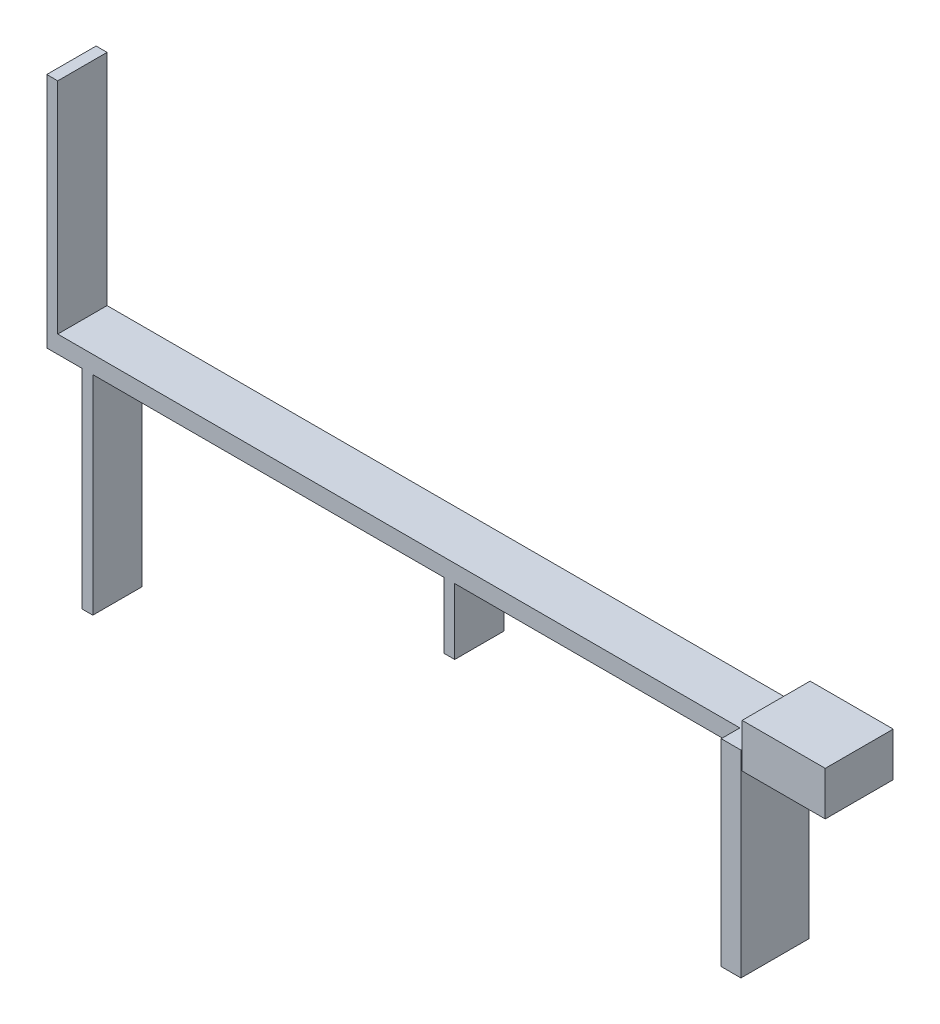
ISO-10303-21;
HEADER;
FILE_DESCRIPTION(('STEP AP214'),'2;1');
FILE_NAME('part.step','',(''),(''),'','','');
FILE_SCHEMA(('AUTOMOTIVE_DESIGN { 1 0 10303 214 1 1 1 1 }'));
ENDSEC;
DATA;
#1=APPLICATION_CONTEXT('core data for automotive mechanical design processes');
#2=APPLICATION_PROTOCOL_DEFINITION('international standard','automotive_design',2000,#1);
#3=PRODUCT_CONTEXT('',#1,'mechanical');
#4=PRODUCT('Part','Part','',(#3));
#5=PRODUCT_RELATED_PRODUCT_CATEGORY('part','',(#4));
#6=PRODUCT_DEFINITION_FORMATION('','',#4);
#7=PRODUCT_DEFINITION_CONTEXT('part definition',#1,'design');
#8=PRODUCT_DEFINITION('design','',#6,#7);
#9=PRODUCT_DEFINITION_SHAPE('','',#8);
#10=(LENGTH_UNIT() NAMED_UNIT(*) SI_UNIT(.MILLI.,.METRE.));
#11=(NAMED_UNIT(*) PLANE_ANGLE_UNIT() SI_UNIT($,.RADIAN.));
#12=(NAMED_UNIT(*) SI_UNIT($,.STERADIAN.) SOLID_ANGLE_UNIT());
#13=UNCERTAINTY_MEASURE_WITH_UNIT(LENGTH_MEASURE(1.E-05),#10,'distance_accuracy_value','');
#14=(GEOMETRIC_REPRESENTATION_CONTEXT(3) GLOBAL_UNCERTAINTY_ASSIGNED_CONTEXT((#13)) GLOBAL_UNIT_ASSIGNED_CONTEXT((#10,
#11,#12)) REPRESENTATION_CONTEXT('',''));
#15=CARTESIAN_POINT('',(0.,0.,0.));
#16=DIRECTION('',(0.,0.,1.));
#17=DIRECTION('',(1.,0.,0.));
#18=AXIS2_PLACEMENT_3D('',#15,#16,#17);
#19=CARTESIAN_POINT('',(-6183.69738862963,16097.6944154576,6200.));
#20=DIRECTION('',(-1.,0.,0.));
#21=DIRECTION('',(0.,0.,1.));
#22=AXIS2_PLACEMENT_3D('',#19,#20,#21);
#23=PLANE('',#22);
#24=DIRECTION('',(0.,0.,-1.));
#25=VECTOR('',#24,1.);
#26=CARTESIAN_POINT('',(-6183.69738862963,34097.6944154576,6200.));
#27=LINE('',#26,#25);
#28=CARTESIAN_POINT('',(-6183.69738862963,34097.6944154576,6200.));
#29=VERTEX_POINT('',#28);
#30=CARTESIAN_POINT('',(-6183.69738862963,34097.6944154577,4500.));
#31=VERTEX_POINT('',#30);
#32=EDGE_CURVE('E100',#29,#31,#27,.T.);
#33=ORIENTED_EDGE('',*,*,#32,.T.);
#34=DIRECTION('',(0.,-1.,0.));
#35=VECTOR('',#34,1.);
#36=CARTESIAN_POINT('',(-6183.69738862963,34097.6944154577,4500.));
#37=LINE('',#36,#35);
#38=CARTESIAN_POINT('',(-6183.69738862963,32497.6944154576,4500.));
#39=VERTEX_POINT('',#38);
#40=EDGE_CURVE('E255',#31,#39,#37,.T.);
#41=ORIENTED_EDGE('',*,*,#40,.T.);
#42=DIRECTION('',(0.,0.,-1.));
#43=VECTOR('',#42,1.);
#44=CARTESIAN_POINT('',(-6183.69738862963,32497.6944154576,4500.));
#45=LINE('',#44,#43);
#46=CARTESIAN_POINT('',(-6183.69738862963,32497.6944154576,0.));
#47=VERTEX_POINT('',#46);
#48=EDGE_CURVE('E242',#39,#47,#45,.T.);
#49=ORIENTED_EDGE('',*,*,#48,.T.);
#50=DIRECTION('',(0.,1.,0.));
#51=VECTOR('',#50,1.);
#52=CARTESIAN_POINT('',(-6183.69738862963,16097.6944154576,0.));
#53=LINE('',#52,#51);
#54=CARTESIAN_POINT('',(-6183.69738862963,16097.6944154576,0.));
#55=VERTEX_POINT('',#54);
#56=EDGE_CURVE('E334',#55,#47,#53,.T.);
#57=ORIENTED_EDGE('',*,*,#56,.F.);
#58=DIRECTION('',(0.,0.,-1.));
#59=VECTOR('',#58,1.);
#60=CARTESIAN_POINT('',(-6183.69738862963,16097.6944154576,6200.));
#61=LINE('',#60,#59);
#62=CARTESIAN_POINT('',(-6183.69738862963,16097.6944154576,6200.));
#63=VERTEX_POINT('',#62);
#64=EDGE_CURVE('E343',#63,#55,#61,.T.);
#65=ORIENTED_EDGE('',*,*,#64,.F.);
#66=DIRECTION('',(0.,1.,0.));
#67=VECTOR('',#66,1.);
#68=CARTESIAN_POINT('',(-6183.69738862963,16097.6944154576,6200.));
#69=LINE('',#68,#67);
#70=EDGE_CURVE('E323',#63,#29,#69,.T.);
#71=ORIENTED_EDGE('',*,*,#70,.T.);
#72=EDGE_LOOP('',(#33,#41,#49,#57,#65,#71));
#73=FACE_BOUND('',#72,.T.);
#74=ADVANCED_FACE('F91',(#73),#23,.T.);
#75=CARTESIAN_POINT('',(-4383.69738862963,16097.6944154576,6200.));
#76=DIRECTION('',(1.,0.,0.));
#77=DIRECTION('',(0.,0.,-1.));
#78=AXIS2_PLACEMENT_3D('',#75,#76,#77);
#79=PLANE('',#78);
#80=DIRECTION('',(0.,-1.,0.));
#81=VECTOR('',#80,1.);
#82=CARTESIAN_POINT('',(-4383.69738862963,16097.6944154576,0.));
#83=LINE('',#82,#81);
#84=CARTESIAN_POINT('',(-4383.69738862963,34097.6944154576,0.));
#85=VERTEX_POINT('',#84);
#86=CARTESIAN_POINT('',(-4383.69738862963,16097.6944154576,0.));
#87=VERTEX_POINT('',#86);
#88=EDGE_CURVE('E328',#85,#87,#83,.T.);
#89=ORIENTED_EDGE('',*,*,#88,.F.);
#90=DIRECTION('',(0.,0.,-1.));
#91=VECTOR('',#90,1.);
#92=CARTESIAN_POINT('',(-4383.69738862963,34097.6944154576,6200.));
#93=LINE('',#92,#91);
#94=CARTESIAN_POINT('',(-4383.69738862963,34097.6944154576,6200.));
#95=VERTEX_POINT('',#94);
#96=EDGE_CURVE('E13',#95,#85,#93,.T.);
#97=ORIENTED_EDGE('',*,*,#96,.F.);
#98=DIRECTION('',(0.,-1.,0.));
#99=VECTOR('',#98,1.);
#100=CARTESIAN_POINT('',(-4383.69738862963,16097.6944154576,6200.));
#101=LINE('',#100,#99);
#102=CARTESIAN_POINT('',(-4383.69738862963,16097.6944154576,6200.));
#103=VERTEX_POINT('',#102);
#104=EDGE_CURVE('E318',#95,#103,#101,.T.);
#105=ORIENTED_EDGE('',*,*,#104,.T.);
#106=DIRECTION('',(0.,0.,-1.));
#107=VECTOR('',#106,1.);
#108=CARTESIAN_POINT('',(-4383.69738862963,16097.6944154576,6200.));
#109=LINE('',#108,#107);
#110=EDGE_CURVE('E138',#103,#87,#109,.T.);
#111=ORIENTED_EDGE('',*,*,#110,.T.);
#112=EDGE_LOOP('',(#89,#97,#105,#111));
#113=FACE_BOUND('',#112,.T.);
#114=ADVANCED_FACE('F93',(#113),#79,.T.);
#115=CARTESIAN_POINT('',(-4383.69738862963,34097.6944154576,6200.));
#116=DIRECTION('',(0.,1.,0.));
#117=DIRECTION('',(0.,0.,1.));
#118=AXIS2_PLACEMENT_3D('',#115,#116,#117);
#119=PLANE('',#118);
#120=DIRECTION('',(1.,0.,0.));
#121=VECTOR('',#120,1.);
#122=CARTESIAN_POINT('',(-4383.69738862963,34097.6944154576,0.));
#123=LINE('',#122,#121);
#124=CARTESIAN_POINT('',(-68383.6973886296,34097.6944154576,0.));
#125=VERTEX_POINT('',#124);
#126=EDGE_CURVE('E321',#125,#85,#123,.T.);
#127=ORIENTED_EDGE('',*,*,#126,.F.);
#128=DIRECTION('',(0.,0.,-1.));
#129=VECTOR('',#128,1.);
#130=CARTESIAN_POINT('',(-68383.6973886296,34097.6944154576,4500.));
#131=LINE('',#130,#129);
#132=CARTESIAN_POINT('',(-68383.6973886296,34097.6944154576,4500.));
#133=VERTEX_POINT('',#132);
#134=EDGE_CURVE('E241',#133,#125,#131,.T.);
#135=ORIENTED_EDGE('',*,*,#134,.F.);
#136=DIRECTION('',(-1.,0.,0.));
#137=VECTOR('',#136,1.);
#138=CARTESIAN_POINT('',(-6183.69738862963,34097.6944154577,4500.));
#139=LINE('',#138,#137);
#140=EDGE_CURVE('E247',#31,#133,#139,.T.);
#141=ORIENTED_EDGE('',*,*,#140,.F.);
#142=ORIENTED_EDGE('',*,*,#32,.F.);
#143=DIRECTION('',(1.,0.,0.));
#144=VECTOR('',#143,1.);
#145=CARTESIAN_POINT('',(-4383.69738862963,34097.6944154576,6200.));
#146=LINE('',#145,#144);
#147=EDGE_CURVE('E326',#29,#95,#146,.T.);
#148=ORIENTED_EDGE('',*,*,#147,.T.);
#149=ORIENTED_EDGE('',*,*,#96,.T.);
#150=EDGE_LOOP('',(#127,#135,#141,#142,#148,#149));
#151=FACE_BOUND('',#150,.T.);
#152=ADVANCED_FACE('F457',(#151),#119,.T.);
#153=CARTESIAN_POINT('',(-4383.69738862963,16097.6944154576,6200.));
#154=DIRECTION('',(0.,-1.,0.));
#155=DIRECTION('',(0.,0.,-1.));
#156=AXIS2_PLACEMENT_3D('',#153,#154,#155);
#157=PLANE('',#156);
#158=DIRECTION('',(-1.,0.,0.));
#159=VECTOR('',#158,1.);
#160=CARTESIAN_POINT('',(-4383.69738862963,16097.6944154576,0.));
#161=LINE('',#160,#159);
#162=EDGE_CURVE('E330',#87,#55,#161,.T.);
#163=ORIENTED_EDGE('',*,*,#162,.F.);
#164=ORIENTED_EDGE('',*,*,#110,.F.);
#165=DIRECTION('',(-1.,0.,0.));
#166=VECTOR('',#165,1.);
#167=CARTESIAN_POINT('',(-4383.69738862963,16097.6944154576,6200.));
#168=LINE('',#167,#166);
#169=EDGE_CURVE('E320',#103,#63,#168,.T.);
#170=ORIENTED_EDGE('',*,*,#169,.T.);
#171=ORIENTED_EDGE('',*,*,#64,.T.);
#172=EDGE_LOOP('',(#163,#164,#170,#171));
#173=FACE_BOUND('',#172,.T.);
#174=ADVANCED_FACE('F348',(#173),#157,.T.);
#175=CARTESIAN_POINT('',(-4383.69738862963,34097.6944154576,6200.));
#176=DIRECTION('',(0.,0.,1.));
#177=DIRECTION('',(1.,0.,0.));
#178=AXIS2_PLACEMENT_3D('',#175,#176,#177);
#179=PLANE('',#178);
#180=ORIENTED_EDGE('',*,*,#104,.F.);
#181=ORIENTED_EDGE('',*,*,#147,.F.);
#182=ORIENTED_EDGE('',*,*,#70,.F.);
#183=ORIENTED_EDGE('',*,*,#169,.F.);
#184=EDGE_LOOP('',(#180,#181,#182,#183));
#185=FACE_BOUND('',#184,.T.);
#186=ADVANCED_FACE('F461',(#185),#179,.T.);
#187=CARTESIAN_POINT('',(-4383.69738862963,34097.6944154576,0.));
#188=DIRECTION('',(0.,0.,1.));
#189=DIRECTION('',(1.,0.,0.));
#190=AXIS2_PLACEMENT_3D('',#187,#188,#189);
#191=PLANE('',#190);
#192=ORIENTED_EDGE('',*,*,#88,.T.);
#193=ORIENTED_EDGE('',*,*,#162,.T.);
#194=ORIENTED_EDGE('',*,*,#56,.T.);
#195=DIRECTION('',(-1.,0.,0.));
#196=VECTOR('',#195,1.);
#197=CARTESIAN_POINT('',(-6183.69738862963,32497.6944154576,0.));
#198=LINE('',#197,#196);
#199=CARTESIAN_POINT('',(-32183.6973886296,32497.6944154576,0.));
#200=VERTEX_POINT('',#199);
#201=EDGE_CURVE('E108',#47,#200,#198,.T.);
#202=ORIENTED_EDGE('',*,*,#201,.T.);
#203=DIRECTION('',(0.,-1.,0.));
#204=VECTOR('',#203,1.);
#205=CARTESIAN_POINT('',(-32183.6973886296,32497.6944154576,0.));
#206=LINE('',#205,#204);
#207=CARTESIAN_POINT('',(-32183.6973886296,26497.6944154576,0.));
#208=VERTEX_POINT('',#207);
#209=EDGE_CURVE('E303',#200,#208,#206,.T.);
#210=ORIENTED_EDGE('',*,*,#209,.T.);
#211=DIRECTION('',(1.,0.,0.));
#212=VECTOR('',#211,1.);
#213=CARTESIAN_POINT('',(-33183.6973886296,26497.6944154576,0.));
#214=LINE('',#213,#212);
#215=CARTESIAN_POINT('',(-33183.6973886296,26497.6944154576,0.));
#216=VERTEX_POINT('',#215);
#217=EDGE_CURVE('E306',#216,#208,#214,.T.);
#218=ORIENTED_EDGE('',*,*,#217,.F.);
#219=DIRECTION('',(0.,-1.,0.));
#220=VECTOR('',#219,1.);
#221=CARTESIAN_POINT('',(-33183.6973886296,32497.6944154576,0.));
#222=LINE('',#221,#220);
#223=CARTESIAN_POINT('',(-33183.6973886296,32497.6944154576,0.));
#224=VERTEX_POINT('',#223);
#225=EDGE_CURVE('E300',#224,#216,#222,.T.);
#226=ORIENTED_EDGE('',*,*,#225,.F.);
#227=CARTESIAN_POINT('',(-65183.6973886296,32497.6944154576,0.));
#228=VERTEX_POINT('',#227);
#229=EDGE_CURVE('E270',#224,#228,#198,.T.);
#230=ORIENTED_EDGE('',*,*,#229,.T.);
#231=DIRECTION('',(0.,-1.,0.));
#232=VECTOR('',#231,1.);
#233=CARTESIAN_POINT('',(-65183.6973886296,32497.6944154576,0.));
#234=LINE('',#233,#232);
#235=CARTESIAN_POINT('',(-65183.6973886296,13497.6944154576,0.));
#236=VERTEX_POINT('',#235);
#237=EDGE_CURVE('E288',#228,#236,#234,.T.);
#238=ORIENTED_EDGE('',*,*,#237,.T.);
#239=DIRECTION('',(-1.,0.,0.));
#240=VECTOR('',#239,1.);
#241=CARTESIAN_POINT('',(-65183.6973886296,13497.6944154576,0.));
#242=LINE('',#241,#240);
#243=CARTESIAN_POINT('',(-66183.6973886297,13497.6944154576,0.));
#244=VERTEX_POINT('',#243);
#245=EDGE_CURVE('E284',#236,#244,#242,.T.);
#246=ORIENTED_EDGE('',*,*,#245,.T.);
#247=DIRECTION('',(0.,-1.,0.));
#248=VECTOR('',#247,1.);
#249=CARTESIAN_POINT('',(-66183.6973886296,32497.6944154576,0.));
#250=LINE('',#249,#248);
#251=CARTESIAN_POINT('',(-66183.6973886296,32497.6944154576,0.));
#252=VERTEX_POINT('',#251);
#253=EDGE_CURVE('E282',#252,#244,#250,.T.);
#254=ORIENTED_EDGE('',*,*,#253,.F.);
#255=CARTESIAN_POINT('',(-69383.6973886296,32497.6944154576,0.));
#256=VERTEX_POINT('',#255);
#257=EDGE_CURVE('E262',#252,#256,#198,.T.);
#258=ORIENTED_EDGE('',*,*,#257,.T.);
#259=DIRECTION('',(0.,-1.,0.));
#260=VECTOR('',#259,1.);
#261=CARTESIAN_POINT('',(-69383.6973886296,34097.6944154576,0.));
#262=LINE('',#261,#260);
#263=CARTESIAN_POINT('',(-69383.6973886296,54097.6944154576,0.));
#264=VERTEX_POINT('',#263);
#265=EDGE_CURVE('E240',#264,#256,#262,.T.);
#266=ORIENTED_EDGE('',*,*,#265,.F.);
#267=DIRECTION('',(1.,0.,0.));
#268=VECTOR('',#267,1.);
#269=CARTESIAN_POINT('',(-69383.6973886296,54097.6944154576,0.));
#270=LINE('',#269,#268);
#271=CARTESIAN_POINT('',(-68383.6973886296,54097.6944154576,0.));
#272=VERTEX_POINT('',#271);
#273=EDGE_CURVE('E374',#264,#272,#270,.T.);
#274=ORIENTED_EDGE('',*,*,#273,.T.);
#275=DIRECTION('',(0.,1.,0.));
#276=VECTOR('',#275,1.);
#277=CARTESIAN_POINT('',(-68383.6973886296,34097.6944154576,0.));
#278=LINE('',#277,#276);
#279=EDGE_CURVE('E351',#125,#272,#278,.T.);
#280=ORIENTED_EDGE('',*,*,#279,.F.);
#281=ORIENTED_EDGE('',*,*,#126,.T.);
#282=EDGE_LOOP('',(#192,#193,#194,#202,#210,#218,#226,#230,#238,#246,#254,#258,#266,#274,#280,#281));
#283=FACE_BOUND('',#282,.T.);
#284=ADVANCED_FACE('F278',(#283),#191,.F.);
#285=CARTESIAN_POINT('',(-69383.6973886296,34097.6944154576,4500.));
#286=DIRECTION('',(1.,0.,0.));
#287=DIRECTION('',(0.,0.,-1.));
#288=AXIS2_PLACEMENT_3D('',#285,#286,#287);
#289=PLANE('',#288);
#290=ORIENTED_EDGE('',*,*,#265,.T.);
#291=DIRECTION('',(0.,0.,-1.));
#292=VECTOR('',#291,1.);
#293=CARTESIAN_POINT('',(-69383.6973886296,32497.6944154576,4500.));
#294=LINE('',#293,#292);
#295=CARTESIAN_POINT('',(-69383.6973886296,32497.6944154576,4500.));
#296=VERTEX_POINT('',#295);
#297=EDGE_CURVE('E223',#296,#256,#294,.T.);
#298=ORIENTED_EDGE('',*,*,#297,.F.);
#299=DIRECTION('',(0.,-1.,0.));
#300=VECTOR('',#299,1.);
#301=CARTESIAN_POINT('',(-69383.6973886296,34097.6944154576,4500.));
#302=LINE('',#301,#300);
#303=CARTESIAN_POINT('',(-69383.6973886296,54097.6944154576,4500.));
#304=VERTEX_POINT('',#303);
#305=EDGE_CURVE('E229',#304,#296,#302,.T.);
#306=ORIENTED_EDGE('',*,*,#305,.F.);
#307=DIRECTION('',(0.,0.,-1.));
#308=VECTOR('',#307,1.);
#309=CARTESIAN_POINT('',(-69383.6973886296,54097.6944154576,4500.));
#310=LINE('',#309,#308);
#311=EDGE_CURVE('E379',#304,#264,#310,.T.);
#312=ORIENTED_EDGE('',*,*,#311,.T.);
#313=EDGE_LOOP('',(#290,#298,#306,#312));
#314=FACE_BOUND('',#313,.T.);
#315=ADVANCED_FACE('F239',(#314),#289,.F.);
#316=CARTESIAN_POINT('',(-69383.6973886296,32497.6944154576,4500.));
#317=DIRECTION('',(0.,0.,-1.));
#318=DIRECTION('',(-1.,0.,0.));
#319=AXIS2_PLACEMENT_3D('',#316,#317,#318);
#320=PLANE('',#319);
#321=ORIENTED_EDGE('',*,*,#305,.T.);
#322=DIRECTION('',(-1.,0.,0.));
#323=VECTOR('',#322,1.);
#324=CARTESIAN_POINT('',(-6183.69738862963,32497.6944154576,4500.));
#325=LINE('',#324,#323);
#326=CARTESIAN_POINT('',(-66183.6973886296,32497.6944154576,4500.));
#327=VERTEX_POINT('',#326);
#328=EDGE_CURVE('E218',#327,#296,#325,.T.);
#329=ORIENTED_EDGE('',*,*,#328,.F.);
#330=DIRECTION('',(0.,-1.,0.));
#331=VECTOR('',#330,1.);
#332=CARTESIAN_POINT('',(-66183.6973886296,32497.6944154576,4500.));
#333=LINE('',#332,#331);
#334=CARTESIAN_POINT('',(-66183.6973886297,13497.6944154576,4500.));
#335=VERTEX_POINT('',#334);
#336=EDGE_CURVE('E391',#327,#335,#333,.T.);
#337=ORIENTED_EDGE('',*,*,#336,.T.);
#338=DIRECTION('',(-1.,0.,0.));
#339=VECTOR('',#338,1.);
#340=CARTESIAN_POINT('',(-65183.6973886296,13497.6944154576,4500.));
#341=LINE('',#340,#339);
#342=CARTESIAN_POINT('',(-65183.6973886296,13497.6944154576,4500.));
#343=VERTEX_POINT('',#342);
#344=EDGE_CURVE('E387',#343,#335,#341,.T.);
#345=ORIENTED_EDGE('',*,*,#344,.F.);
#346=DIRECTION('',(0.,-1.,0.));
#347=VECTOR('',#346,1.);
#348=CARTESIAN_POINT('',(-65183.6973886296,32497.6944154576,4500.));
#349=LINE('',#348,#347);
#350=CARTESIAN_POINT('',(-65183.6973886296,32497.6944154576,4500.));
#351=VERTEX_POINT('',#350);
#352=EDGE_CURVE('E373',#351,#343,#349,.T.);
#353=ORIENTED_EDGE('',*,*,#352,.F.);
#354=CARTESIAN_POINT('',(-33183.6973886296,32497.6944154576,4500.));
#355=VERTEX_POINT('',#354);
#356=EDGE_CURVE('E228',#355,#351,#325,.T.);
#357=ORIENTED_EDGE('',*,*,#356,.F.);
#358=DIRECTION('',(0.,-1.,0.));
#359=VECTOR('',#358,1.);
#360=CARTESIAN_POINT('',(-33183.6973886296,32497.6944154576,4500.));
#361=LINE('',#360,#359);
#362=CARTESIAN_POINT('',(-33183.6973886296,26497.6944154576,4500.));
#363=VERTEX_POINT('',#362);
#364=EDGE_CURVE('E310',#355,#363,#361,.T.);
#365=ORIENTED_EDGE('',*,*,#364,.T.);
#366=DIRECTION('',(1.,0.,0.));
#367=VECTOR('',#366,1.);
#368=CARTESIAN_POINT('',(-33183.6973886296,26497.6944154576,4500.));
#369=LINE('',#368,#367);
#370=CARTESIAN_POINT('',(-32183.6973886296,26497.6944154576,4500.));
#371=VERTEX_POINT('',#370);
#372=EDGE_CURVE('E299',#363,#371,#369,.T.);
#373=ORIENTED_EDGE('',*,*,#372,.T.);
#374=DIRECTION('',(0.,-1.,0.));
#375=VECTOR('',#374,1.);
#376=CARTESIAN_POINT('',(-32183.6973886296,32497.6944154576,4500.));
#377=LINE('',#376,#375);
#378=CARTESIAN_POINT('',(-32183.6973886296,32497.6944154576,4500.));
#379=VERTEX_POINT('',#378);
#380=EDGE_CURVE('E296',#379,#371,#377,.T.);
#381=ORIENTED_EDGE('',*,*,#380,.F.);
#382=EDGE_CURVE('E355',#39,#379,#325,.T.);
#383=ORIENTED_EDGE('',*,*,#382,.F.);
#384=ORIENTED_EDGE('',*,*,#40,.F.);
#385=ORIENTED_EDGE('',*,*,#140,.T.);
#386=DIRECTION('',(0.,1.,0.));
#387=VECTOR('',#386,1.);
#388=CARTESIAN_POINT('',(-68383.6973886296,34097.6944154576,4500.));
#389=LINE('',#388,#387);
#390=CARTESIAN_POINT('',(-68383.6973886296,54097.6944154576,4500.));
#391=VERTEX_POINT('',#390);
#392=EDGE_CURVE('E377',#133,#391,#389,.T.);
#393=ORIENTED_EDGE('',*,*,#392,.T.);
#394=DIRECTION('',(1.,0.,0.));
#395=VECTOR('',#394,1.);
#396=CARTESIAN_POINT('',(-69383.6973886296,54097.6944154576,4500.));
#397=LINE('',#396,#395);
#398=EDGE_CURVE('E234',#304,#391,#397,.T.);
#399=ORIENTED_EDGE('',*,*,#398,.F.);
#400=EDGE_LOOP('',(#321,#329,#337,#345,#353,#357,#365,#373,#381,#383,#384,#385,#393,#399));
#401=FACE_BOUND('',#400,.T.);
#402=ADVANCED_FACE('F232',(#401),#320,.F.);
#403=CARTESIAN_POINT('',(-6183.69738862963,32497.6944154576,4500.));
#404=DIRECTION('',(0.,-1.,0.));
#405=DIRECTION('',(1.,0.,0.));
#406=AXIS2_PLACEMENT_3D('',#403,#404,#405);
#407=PLANE('',#406);
#408=DIRECTION('',(0.,0.,-1.));
#409=VECTOR('',#408,1.);
#410=CARTESIAN_POINT('',(-33183.6973886296,32497.6944154576,4500.));
#411=LINE('',#410,#409);
#412=EDGE_CURVE('E331',#355,#224,#411,.T.);
#413=ORIENTED_EDGE('',*,*,#412,.F.);
#414=ORIENTED_EDGE('',*,*,#356,.T.);
#415=DIRECTION('',(0.,0.,-1.));
#416=VECTOR('',#415,1.);
#417=CARTESIAN_POINT('',(-65183.6973886296,32497.6944154576,4500.));
#418=LINE('',#417,#416);
#419=EDGE_CURVE('E245',#351,#228,#418,.T.);
#420=ORIENTED_EDGE('',*,*,#419,.T.);
#421=ORIENTED_EDGE('',*,*,#229,.F.);
#422=EDGE_LOOP('',(#413,#414,#420,#421));
#423=FACE_BOUND('',#422,.T.);
#424=ADVANCED_FACE('F431',(#423),#407,.T.);
#425=DIRECTION('',(0.,0.,-1.));
#426=VECTOR('',#425,1.);
#427=CARTESIAN_POINT('',(-66183.6973886296,32497.6944154576,4500.));
#428=LINE('',#427,#426);
#429=EDGE_CURVE('E225',#327,#252,#428,.T.);
#430=ORIENTED_EDGE('',*,*,#429,.F.);
#431=ORIENTED_EDGE('',*,*,#328,.T.);
#432=ORIENTED_EDGE('',*,*,#297,.T.);
#433=ORIENTED_EDGE('',*,*,#257,.F.);
#434=EDGE_LOOP('',(#430,#431,#432,#433));
#435=FACE_BOUND('',#434,.T.);
#436=ADVANCED_FACE('F220',(#435),#407,.T.);
#437=ORIENTED_EDGE('',*,*,#382,.T.);
#438=DIRECTION('',(0.,0.,-1.));
#439=VECTOR('',#438,1.);
#440=CARTESIAN_POINT('',(-32183.6973886296,32497.6944154576,4500.));
#441=LINE('',#440,#439);
#442=EDGE_CURVE('E405',#379,#200,#441,.T.);
#443=ORIENTED_EDGE('',*,*,#442,.T.);
#444=ORIENTED_EDGE('',*,*,#201,.F.);
#445=ORIENTED_EDGE('',*,*,#48,.F.);
#446=EDGE_LOOP('',(#437,#443,#444,#445));
#447=FACE_BOUND('',#446,.T.);
#448=ADVANCED_FACE('F424',(#447),#407,.T.);
#449=CARTESIAN_POINT('',(-69383.6973886296,54097.6944154576,4500.));
#450=DIRECTION('',(0.,1.,0.));
#451=DIRECTION('',(0.,0.,1.));
#452=AXIS2_PLACEMENT_3D('',#449,#450,#451);
#453=PLANE('',#452);
#454=ORIENTED_EDGE('',*,*,#273,.F.);
#455=ORIENTED_EDGE('',*,*,#311,.F.);
#456=ORIENTED_EDGE('',*,*,#398,.T.);
#457=DIRECTION('',(0.,0.,-1.));
#458=VECTOR('',#457,1.);
#459=CARTESIAN_POINT('',(-68383.6973886296,54097.6944154576,4500.));
#460=LINE('',#459,#458);
#461=EDGE_CURVE('E307',#391,#272,#460,.T.);
#462=ORIENTED_EDGE('',*,*,#461,.T.);
#463=EDGE_LOOP('',(#454,#455,#456,#462));
#464=FACE_BOUND('',#463,.T.);
#465=ADVANCED_FACE('F450',(#464),#453,.T.);
#466=CARTESIAN_POINT('',(-68383.6973886296,34097.6944154576,4500.));
#467=DIRECTION('',(-1.,0.,0.));
#468=DIRECTION('',(0.,0.,1.));
#469=AXIS2_PLACEMENT_3D('',#466,#467,#468);
#470=PLANE('',#469);
#471=ORIENTED_EDGE('',*,*,#279,.T.);
#472=ORIENTED_EDGE('',*,*,#461,.F.);
#473=ORIENTED_EDGE('',*,*,#392,.F.);
#474=ORIENTED_EDGE('',*,*,#134,.T.);
#475=EDGE_LOOP('',(#471,#472,#473,#474));
#476=FACE_BOUND('',#475,.T.);
#477=ADVANCED_FACE('F448',(#476),#470,.F.);
#478=CARTESIAN_POINT('',(-65183.6973886296,13497.6944154576,4500.));
#479=DIRECTION('',(0.,-1.,0.));
#480=DIRECTION('',(0.,0.,-1.));
#481=AXIS2_PLACEMENT_3D('',#478,#479,#480);
#482=PLANE('',#481);
#483=ORIENTED_EDGE('',*,*,#245,.F.);
#484=DIRECTION('',(0.,0.,-1.));
#485=VECTOR('',#484,1.);
#486=CARTESIAN_POINT('',(-65183.6973886296,13497.6944154576,4500.));
#487=LINE('',#486,#485);
#488=EDGE_CURVE('E370',#343,#236,#487,.T.);
#489=ORIENTED_EDGE('',*,*,#488,.F.);
#490=ORIENTED_EDGE('',*,*,#344,.T.);
#491=DIRECTION('',(0.,0.,-1.));
#492=VECTOR('',#491,1.);
#493=CARTESIAN_POINT('',(-66183.6973886297,13497.6944154576,4500.));
#494=LINE('',#493,#492);
#495=EDGE_CURVE('E372',#335,#244,#494,.T.);
#496=ORIENTED_EDGE('',*,*,#495,.T.);
#497=EDGE_LOOP('',(#483,#489,#490,#496));
#498=FACE_BOUND('',#497,.T.);
#499=ADVANCED_FACE('F435',(#498),#482,.T.);
#500=CARTESIAN_POINT('',(-65183.6973886296,32497.6944154576,4500.));
#501=DIRECTION('',(1.,0.,0.));
#502=DIRECTION('',(0.,0.,-1.));
#503=AXIS2_PLACEMENT_3D('',#500,#501,#502);
#504=PLANE('',#503);
#505=ORIENTED_EDGE('',*,*,#237,.F.);
#506=ORIENTED_EDGE('',*,*,#419,.F.);
#507=ORIENTED_EDGE('',*,*,#352,.T.);
#508=ORIENTED_EDGE('',*,*,#488,.T.);
#509=EDGE_LOOP('',(#505,#506,#507,#508));
#510=FACE_BOUND('',#509,.T.);
#511=ADVANCED_FACE('F434',(#510),#504,.T.);
#512=CARTESIAN_POINT('',(-66183.6973886296,32497.6944154576,4500.));
#513=DIRECTION('',(1.,0.,0.));
#514=DIRECTION('',(0.,1.,0.));
#515=AXIS2_PLACEMENT_3D('',#512,#513,#514);
#516=PLANE('',#515);
#517=ORIENTED_EDGE('',*,*,#253,.T.);
#518=ORIENTED_EDGE('',*,*,#495,.F.);
#519=ORIENTED_EDGE('',*,*,#336,.F.);
#520=ORIENTED_EDGE('',*,*,#429,.T.);
#521=EDGE_LOOP('',(#517,#518,#519,#520));
#522=FACE_BOUND('',#521,.T.);
#523=ADVANCED_FACE('F436',(#522),#516,.F.);
#524=CARTESIAN_POINT('',(-33183.6973886296,26497.6944154576,4500.));
#525=DIRECTION('',(0.,1.,0.));
#526=DIRECTION('',(0.,0.,1.));
#527=AXIS2_PLACEMENT_3D('',#524,#525,#526);
#528=PLANE('',#527);
#529=ORIENTED_EDGE('',*,*,#217,.T.);
#530=DIRECTION('',(0.,0.,-1.));
#531=VECTOR('',#530,1.);
#532=CARTESIAN_POINT('',(-32183.6973886296,26497.6944154576,4500.));
#533=LINE('',#532,#531);
#534=EDGE_CURVE('E312',#371,#208,#533,.T.);
#535=ORIENTED_EDGE('',*,*,#534,.F.);
#536=ORIENTED_EDGE('',*,*,#372,.F.);
#537=DIRECTION('',(0.,0.,-1.));
#538=VECTOR('',#537,1.);
#539=CARTESIAN_POINT('',(-33183.6973886296,26497.6944154576,4500.));
#540=LINE('',#539,#538);
#541=EDGE_CURVE('E263',#363,#216,#540,.T.);
#542=ORIENTED_EDGE('',*,*,#541,.T.);
#543=EDGE_LOOP('',(#529,#535,#536,#542));
#544=FACE_BOUND('',#543,.T.);
#545=ADVANCED_FACE('F422',(#544),#528,.F.);
#546=CARTESIAN_POINT('',(-32183.6973886296,32497.6944154576,4500.));
#547=DIRECTION('',(1.,0.,0.));
#548=DIRECTION('',(0.,1.,0.));
#549=AXIS2_PLACEMENT_3D('',#546,#547,#548);
#550=PLANE('',#549);
#551=ORIENTED_EDGE('',*,*,#209,.F.);
#552=ORIENTED_EDGE('',*,*,#442,.F.);
#553=ORIENTED_EDGE('',*,*,#380,.T.);
#554=ORIENTED_EDGE('',*,*,#534,.T.);
#555=EDGE_LOOP('',(#551,#552,#553,#554));
#556=FACE_BOUND('',#555,.T.);
#557=ADVANCED_FACE('F420',(#556),#550,.T.);
#558=CARTESIAN_POINT('',(-33183.6973886296,32497.6944154576,4500.));
#559=DIRECTION('',(1.,0.,0.));
#560=DIRECTION('',(0.,1.,0.));
#561=AXIS2_PLACEMENT_3D('',#558,#559,#560);
#562=PLANE('',#561);
#563=ORIENTED_EDGE('',*,*,#225,.T.);
#564=ORIENTED_EDGE('',*,*,#541,.F.);
#565=ORIENTED_EDGE('',*,*,#364,.F.);
#566=ORIENTED_EDGE('',*,*,#412,.T.);
#567=EDGE_LOOP('',(#563,#564,#565,#566));
#568=FACE_BOUND('',#567,.T.);
#569=ADVANCED_FACE('F429',(#568),#562,.F.);
#570=CLOSED_SHELL('',(#74,#114,#152,#174,#186,#284,#315,#402,#424,#436,#448,#465,#477,#499,#511,
#523,#545,#557,#569));
#571=MANIFOLD_SOLID_BREP('B2',#570);
#572=CARTESIAN_POINT('',(-38930.4515876748,36497.6944154576,6200.));
#573=DIRECTION('',(0.,-1.,0.));
#574=DIRECTION('',(0.,0.,-1.));
#575=AXIS2_PLACEMENT_3D('',#572,#573,#574);
#576=PLANE('',#575);
#577=DIRECTION('',(-1.,0.,0.));
#578=VECTOR('',#577,1.);
#579=CARTESIAN_POINT('',(-38930.4515876748,36497.6944154576,0.));
#580=LINE('',#579,#578);
#581=CARTESIAN_POINT('',(3302.85866592254,36497.6944154576,0.));
#582=VERTEX_POINT('',#581);
#583=CARTESIAN_POINT('',(-4277.01,36497.6944154576,0.));
#584=VERTEX_POINT('',#583);
#585=EDGE_CURVE('E691',#582,#584,#580,.T.);
#586=ORIENTED_EDGE('',*,*,#585,.T.);
#587=DIRECTION('',(0.,0.,-1.));
#588=VECTOR('',#587,1.);
#589=CARTESIAN_POINT('',(-4277.01,36497.6944154576,6200.));
#590=LINE('',#589,#588);
#591=CARTESIAN_POINT('',(-4277.01,36497.6944154576,6200.));
#592=VERTEX_POINT('',#591);
#593=EDGE_CURVE('E89',#592,#584,#590,.T.);
#594=ORIENTED_EDGE('',*,*,#593,.F.);
#595=DIRECTION('',(-1.,0.,0.));
#596=VECTOR('',#595,1.);
#597=CARTESIAN_POINT('',(-38930.4515876748,36497.6944154576,6200.));
#598=LINE('',#597,#596);
#599=CARTESIAN_POINT('',(3302.85866592254,36497.6944154576,6200.));
#600=VERTEX_POINT('',#599);
#601=EDGE_CURVE('E677',#600,#592,#598,.T.);
#602=ORIENTED_EDGE('',*,*,#601,.F.);
#603=DIRECTION('',(0.,0.,-1.));
#604=VECTOR('',#603,1.);
#605=CARTESIAN_POINT('',(3302.85866592254,36497.6944154576,6200.));
#606=LINE('',#605,#604);
#607=EDGE_CURVE('E644',#600,#582,#606,.T.);
#608=ORIENTED_EDGE('',*,*,#607,.T.);
#609=EDGE_LOOP('',(#586,#594,#602,#608));
#610=FACE_BOUND('',#609,.T.);
#611=ADVANCED_FACE('F628',(#610),#576,.F.);
#612=CARTESIAN_POINT('',(-4277.00999999998,-32797.7676060186,6200.));
#613=DIRECTION('',(1.,0.,0.));
#614=DIRECTION('',(0.,1.,0.));
#615=AXIS2_PLACEMENT_3D('',#612,#613,#614);
#616=PLANE('',#615);
#617=DIRECTION('',(0.,-1.,0.));
#618=VECTOR('',#617,1.);
#619=CARTESIAN_POINT('',(-4277.00999999998,-32797.7676060186,0.));
#620=LINE('',#619,#618);
#621=CARTESIAN_POINT('',(-4277.01,32497.6944154576,0.));
#622=VERTEX_POINT('',#621);
#623=EDGE_CURVE('E682',#584,#622,#620,.T.);
#624=ORIENTED_EDGE('',*,*,#623,.T.);
#625=DIRECTION('',(0.,0.,-1.));
#626=VECTOR('',#625,1.);
#627=CARTESIAN_POINT('',(-4277.01,32497.6944154576,6200.));
#628=LINE('',#627,#626);
#629=CARTESIAN_POINT('',(-4277.01,32497.6944154576,6200.));
#630=VERTEX_POINT('',#629);
#631=EDGE_CURVE('E636',#630,#622,#628,.T.);
#632=ORIENTED_EDGE('',*,*,#631,.F.);
#633=DIRECTION('',(0.,-1.,0.));
#634=VECTOR('',#633,1.);
#635=CARTESIAN_POINT('',(-4277.00999999998,-32797.7676060186,6200.));
#636=LINE('',#635,#634);
#637=EDGE_CURVE('E669',#592,#630,#636,.T.);
#638=ORIENTED_EDGE('',*,*,#637,.F.);
#639=ORIENTED_EDGE('',*,*,#593,.T.);
#640=EDGE_LOOP('',(#624,#632,#638,#639));
#641=FACE_BOUND('',#640,.T.);
#642=ADVANCED_FACE('F681',(#641),#616,.F.);
#643=CARTESIAN_POINT('',(-38930.4515876748,32497.6944154576,6200.));
#644=DIRECTION('',(0.,-1.,0.));
#645=DIRECTION('',(0.,0.,-1.));
#646=AXIS2_PLACEMENT_3D('',#643,#644,#645);
#647=PLANE('',#646);
#648=DIRECTION('',(-1.,0.,0.));
#649=VECTOR('',#648,1.);
#650=CARTESIAN_POINT('',(-38930.4515876748,32497.6944154576,0.));
#651=LINE('',#650,#649);
#652=CARTESIAN_POINT('',(3302.85866592254,32497.6944154576,0.));
#653=VERTEX_POINT('',#652);
#654=EDGE_CURVE('E694',#653,#622,#651,.T.);
#655=ORIENTED_EDGE('',*,*,#654,.F.);
#656=DIRECTION('',(0.,0.,-1.));
#657=VECTOR('',#656,1.);
#658=CARTESIAN_POINT('',(3302.85866592254,32497.6944154576,6200.));
#659=LINE('',#658,#657);
#660=CARTESIAN_POINT('',(3302.85866592254,32497.6944154576,6200.));
#661=VERTEX_POINT('',#660);
#662=EDGE_CURVE('E658',#661,#653,#659,.T.);
#663=ORIENTED_EDGE('',*,*,#662,.F.);
#664=DIRECTION('',(-1.,0.,0.));
#665=VECTOR('',#664,1.);
#666=CARTESIAN_POINT('',(-38930.4515876748,32497.6944154576,6200.));
#667=LINE('',#666,#665);
#668=EDGE_CURVE('E676',#661,#630,#667,.T.);
#669=ORIENTED_EDGE('',*,*,#668,.T.);
#670=ORIENTED_EDGE('',*,*,#631,.T.);
#671=EDGE_LOOP('',(#655,#663,#669,#670));
#672=FACE_BOUND('',#671,.T.);
#673=ADVANCED_FACE('F685',(#672),#647,.T.);
#674=CARTESIAN_POINT('',(3302.85866592255,-32797.7676060186,6200.));
#675=DIRECTION('',(1.,0.,0.));
#676=DIRECTION('',(0.,1.,0.));
#677=AXIS2_PLACEMENT_3D('',#674,#675,#676);
#678=PLANE('',#677);
#679=DIRECTION('',(0.,-1.,0.));
#680=VECTOR('',#679,1.);
#681=CARTESIAN_POINT('',(3302.85866592255,-32797.7676060186,0.));
#682=LINE('',#681,#680);
#683=EDGE_CURVE('E696',#582,#653,#682,.T.);
#684=ORIENTED_EDGE('',*,*,#683,.F.);
#685=ORIENTED_EDGE('',*,*,#607,.F.);
#686=DIRECTION('',(0.,-1.,0.));
#687=VECTOR('',#686,1.);
#688=CARTESIAN_POINT('',(3302.85866592255,-32797.7676060186,6200.));
#689=LINE('',#688,#687);
#690=EDGE_CURVE('E686',#600,#661,#689,.T.);
#691=ORIENTED_EDGE('',*,*,#690,.T.);
#692=ORIENTED_EDGE('',*,*,#662,.T.);
#693=EDGE_LOOP('',(#684,#685,#691,#692));
#694=FACE_BOUND('',#693,.T.);
#695=ADVANCED_FACE('F702',(#694),#678,.T.);
#696=CARTESIAN_POINT('',(-38930.4515876748,-32797.7676060186,6200.));
#697=DIRECTION('',(0.,0.,1.));
#698=DIRECTION('',(1.,0.,0.));
#699=AXIS2_PLACEMENT_3D('',#696,#697,#698);
#700=PLANE('',#699);
#701=ORIENTED_EDGE('',*,*,#601,.T.);
#702=ORIENTED_EDGE('',*,*,#637,.T.);
#703=ORIENTED_EDGE('',*,*,#668,.F.);
#704=ORIENTED_EDGE('',*,*,#690,.F.);
#705=EDGE_LOOP('',(#701,#702,#703,#704));
#706=FACE_BOUND('',#705,.T.);
#707=ADVANCED_FACE('F673',(#706),#700,.T.);
#708=CARTESIAN_POINT('',(-38930.4515876748,-32797.7676060186,0.));
#709=DIRECTION('',(0.,0.,1.));
#710=DIRECTION('',(1.,0.,0.));
#711=AXIS2_PLACEMENT_3D('',#708,#709,#710);
#712=PLANE('',#711);
#713=ORIENTED_EDGE('',*,*,#585,.F.);
#714=ORIENTED_EDGE('',*,*,#683,.T.);
#715=ORIENTED_EDGE('',*,*,#654,.T.);
#716=ORIENTED_EDGE('',*,*,#623,.F.);
#717=EDGE_LOOP('',(#713,#714,#715,#716));
#718=FACE_BOUND('',#717,.T.);
#719=ADVANCED_FACE('F701',(#718),#712,.F.);
#720=CLOSED_SHELL('',(#611,#642,#673,#695,#707,#719));
#721=MANIFOLD_SOLID_BREP('B7',#720);
#722=ADVANCED_BREP_SHAPE_REPRESENTATION('',(#18,#571,#721),#14);
#723=SHAPE_DEFINITION_REPRESENTATION(#9,#722);
ENDSEC;
END-ISO-10303-21;
